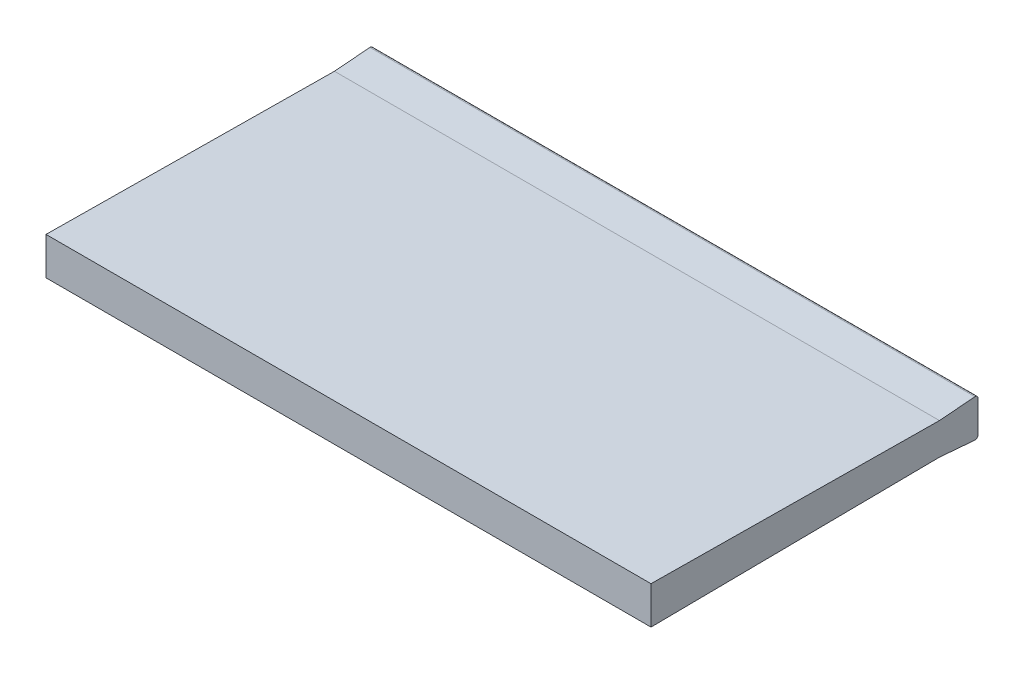
ISO-10303-21;
HEADER;
FILE_DESCRIPTION(('STEP AP214'),'2;1');
FILE_NAME('part.step','',(''),(''),'','','');
FILE_SCHEMA(('AUTOMOTIVE_DESIGN { 1 0 10303 214 1 1 1 1 }'));
ENDSEC;
DATA;
#1=APPLICATION_CONTEXT('core data for automotive mechanical design processes');
#2=APPLICATION_PROTOCOL_DEFINITION('international standard','automotive_design',2000,#1);
#3=PRODUCT_CONTEXT('',#1,'mechanical');
#4=PRODUCT('Part','Part','',(#3));
#5=PRODUCT_RELATED_PRODUCT_CATEGORY('part','',(#4));
#6=PRODUCT_DEFINITION_FORMATION('','',#4);
#7=PRODUCT_DEFINITION_CONTEXT('part definition',#1,'design');
#8=PRODUCT_DEFINITION('design','',#6,#7);
#9=PRODUCT_DEFINITION_SHAPE('','',#8);
#10=(LENGTH_UNIT() NAMED_UNIT(*) SI_UNIT(.MILLI.,.METRE.));
#11=(NAMED_UNIT(*) PLANE_ANGLE_UNIT() SI_UNIT($,.RADIAN.));
#12=(NAMED_UNIT(*) SI_UNIT($,.STERADIAN.) SOLID_ANGLE_UNIT());
#13=UNCERTAINTY_MEASURE_WITH_UNIT(LENGTH_MEASURE(1.E-05),#10,'distance_accuracy_value','');
#14=(GEOMETRIC_REPRESENTATION_CONTEXT(3) GLOBAL_UNCERTAINTY_ASSIGNED_CONTEXT((#13)) GLOBAL_UNIT_ASSIGNED_CONTEXT((#10,
#11,#12)) REPRESENTATION_CONTEXT('',''));
#15=CARTESIAN_POINT('',(0.,0.,0.));
#16=DIRECTION('',(0.,0.,1.));
#17=DIRECTION('',(1.,0.,0.));
#18=AXIS2_PLACEMENT_3D('',#15,#16,#17);
#19=CARTESIAN_POINT('',(-21.,6.15660022588365,-21.));
#20=DIRECTION('',(1.,0.,0.));
#21=DIRECTION('',(0.,1.,0.));
#22=AXIS2_PLACEMENT_3D('',#19,#20,#21);
#23=PLANE('',#22);
#24=CARTESIAN_POINT('',(-21.,6.15660022588365,-21.));
#25=DIRECTION('',(-1.,0.,0.));
#26=DIRECTION('',(0.,0.,-1.));
#27=AXIS2_PLACEMENT_3D('',#24,#25,#26);
#28=CIRCLE('',#27,0.2);
#29=CARTESIAN_POINT('',(-21.,6.35590937753263,-20.9833909040292));
#30=VERTEX_POINT('',#29);
#31=CARTESIAN_POINT('',(-21.,6.15660022588365,-21.2));
#32=VERTEX_POINT('',#31);
#33=EDGE_CURVE('E170',#30,#32,#28,.T.);
#34=ORIENTED_EDGE('',*,*,#33,.T.);
#35=DIRECTION('',(0.,-1.,0.));
#36=VECTOR('',#35,1.);
#37=CARTESIAN_POINT('',(-21.,3.94339977411635,-21.2));
#38=LINE('',#37,#36);
#39=CARTESIAN_POINT('',(-21.,3.94339977411635,-21.2));
#40=VERTEX_POINT('',#39);
#41=EDGE_CURVE('E11',#32,#40,#38,.T.);
#42=ORIENTED_EDGE('',*,*,#41,.T.);
#43=CARTESIAN_POINT('',(-21.,3.94339977411635,-21.));
#44=DIRECTION('',(-1.,0.,0.));
#45=DIRECTION('',(0.,0.,-1.));
#46=AXIS2_PLACEMENT_3D('',#43,#44,#45);
#47=CIRCLE('',#46,0.2);
#48=CARTESIAN_POINT('',(-21.,3.74409062246737,-20.9833909040292));
#49=VERTEX_POINT('',#48);
#50=EDGE_CURVE('E137',#40,#49,#47,.T.);
#51=ORIENTED_EDGE('',*,*,#50,.T.);
#52=DIRECTION('',(0.,0.0830454798537399,0.99654575824488));
#53=VECTOR('',#52,1.);
#54=CARTESIAN_POINT('',(-21.,3.94896372747346,-18.5249136439561));
#55=LINE('',#54,#53);
#56=CARTESIAN_POINT('',(-21.,3.94896372747346,-18.5249136439561));
#57=VERTEX_POINT('',#56);
#58=EDGE_CURVE('E104',#49,#57,#55,.T.);
#59=ORIENTED_EDGE('',*,*,#58,.T.);
#60=DIRECTION('',(0.,-0.0102303753863297,0.999947668340426));
#61=VECTOR('',#60,1.);
#62=CARTESIAN_POINT('',(-21.,3.74409062246737,1.5));
#63=LINE('',#62,#61);
#64=CARTESIAN_POINT('',(-21.,3.74409062246737,1.5));
#65=VERTEX_POINT('',#64);
#66=EDGE_CURVE('E111',#57,#65,#63,.T.);
#67=ORIENTED_EDGE('',*,*,#66,.T.);
#68=DIRECTION('',(0.,1.,0.));
#69=VECTOR('',#68,1.);
#70=CARTESIAN_POINT('',(-21.,6.35590937753263,1.5));
#71=LINE('',#70,#69);
#72=CARTESIAN_POINT('',(-21.,6.35590937753263,1.5));
#73=VERTEX_POINT('',#72);
#74=EDGE_CURVE('E128',#65,#73,#71,.T.);
#75=ORIENTED_EDGE('',*,*,#74,.T.);
#76=DIRECTION('',(0.,-0.0102303753863298,-0.999947668340426));
#77=VECTOR('',#76,1.);
#78=CARTESIAN_POINT('',(-21.,6.15103627252653,-18.5249136439561));
#79=LINE('',#78,#77);
#80=CARTESIAN_POINT('',(-21.,6.15103627252653,-18.5249136439561));
#81=VERTEX_POINT('',#80);
#82=EDGE_CURVE('E157',#73,#81,#79,.T.);
#83=ORIENTED_EDGE('',*,*,#82,.T.);
#84=DIRECTION('',(0.,0.0830454798537402,-0.99654575824488));
#85=VECTOR('',#84,1.);
#86=CARTESIAN_POINT('',(-21.,6.35590937753263,-20.9833909040292));
#87=LINE('',#86,#85);
#88=EDGE_CURVE('E178',#81,#30,#87,.T.);
#89=ORIENTED_EDGE('',*,*,#88,.T.);
#90=EDGE_LOOP('',(#34,#42,#51,#59,#67,#75,#83,#89));
#91=FACE_BOUND('',#90,.T.);
#92=ADVANCED_FACE('F16',(#91),#23,.F.);
#93=CARTESIAN_POINT('',(21.,6.15660022588367,-21.));
#94=DIRECTION('',(1.,0.,0.));
#95=DIRECTION('',(0.,1.,0.));
#96=AXIS2_PLACEMENT_3D('',#93,#94,#95);
#97=PLANE('',#96);
#98=DIRECTION('',(0.,1.,0.));
#99=VECTOR('',#98,1.);
#100=CARTESIAN_POINT('',(21.,3.94339977411637,-21.2));
#101=LINE('',#100,#99);
#102=CARTESIAN_POINT('',(21.,3.94339977411637,-21.2));
#103=VERTEX_POINT('',#102);
#104=CARTESIAN_POINT('',(21.,6.15660022588367,-21.2));
#105=VERTEX_POINT('',#104);
#106=EDGE_CURVE('E20',#103,#105,#101,.T.);
#107=ORIENTED_EDGE('',*,*,#106,.T.);
#108=CARTESIAN_POINT('',(21.,6.15660022588367,-21.));
#109=DIRECTION('',(1.,0.,0.));
#110=DIRECTION('',(0.,0.,-1.));
#111=AXIS2_PLACEMENT_3D('',#108,#109,#110);
#112=CIRCLE('',#111,0.2);
#113=CARTESIAN_POINT('',(21.,6.35590937753265,-20.9833909040292));
#114=VERTEX_POINT('',#113);
#115=EDGE_CURVE('E138',#105,#114,#112,.T.);
#116=ORIENTED_EDGE('',*,*,#115,.T.);
#117=DIRECTION('',(0.,-0.0830454798537402,0.99654575824488));
#118=VECTOR('',#117,1.);
#119=CARTESIAN_POINT('',(21.,6.35590937753265,-20.9833909040292));
#120=LINE('',#119,#118);
#121=CARTESIAN_POINT('',(21.,6.15103627252655,-18.5249136439561));
#122=VERTEX_POINT('',#121);
#123=EDGE_CURVE('E169',#114,#122,#120,.T.);
#124=ORIENTED_EDGE('',*,*,#123,.T.);
#125=DIRECTION('',(0.,0.0102303753863298,0.999947668340426));
#126=VECTOR('',#125,1.);
#127=CARTESIAN_POINT('',(21.,6.15103627252655,-18.5249136439561));
#128=LINE('',#127,#126);
#129=CARTESIAN_POINT('',(21.,6.35590937753265,1.5));
#130=VERTEX_POINT('',#129);
#131=EDGE_CURVE('E160',#122,#130,#128,.T.);
#132=ORIENTED_EDGE('',*,*,#131,.T.);
#133=DIRECTION('',(0.,-1.,0.));
#134=VECTOR('',#133,1.);
#135=CARTESIAN_POINT('',(21.,6.35590937753265,1.5));
#136=LINE('',#135,#134);
#137=CARTESIAN_POINT('',(21.,3.74409062246738,1.5));
#138=VERTEX_POINT('',#137);
#139=EDGE_CURVE('E118',#130,#138,#136,.T.);
#140=ORIENTED_EDGE('',*,*,#139,.T.);
#141=DIRECTION('',(0.,0.0102303753863297,-0.999947668340426));
#142=VECTOR('',#141,1.);
#143=CARTESIAN_POINT('',(21.,3.74409062246738,1.5));
#144=LINE('',#143,#142);
#145=CARTESIAN_POINT('',(21.,3.94896372747348,-18.5249136439561));
#146=VERTEX_POINT('',#145);
#147=EDGE_CURVE('E109',#138,#146,#144,.T.);
#148=ORIENTED_EDGE('',*,*,#147,.T.);
#149=DIRECTION('',(0.,-0.0830454798537399,-0.99654575824488));
#150=VECTOR('',#149,1.);
#151=CARTESIAN_POINT('',(21.,3.94896372747348,-18.5249136439561));
#152=LINE('',#151,#150);
#153=CARTESIAN_POINT('',(21.,3.74409062246738,-20.9833909040292));
#154=VERTEX_POINT('',#153);
#155=EDGE_CURVE('E92',#146,#154,#152,.T.);
#156=ORIENTED_EDGE('',*,*,#155,.T.);
#157=CARTESIAN_POINT('',(21.,3.94339977411637,-21.));
#158=DIRECTION('',(1.,0.,0.));
#159=DIRECTION('',(0.,0.,-1.));
#160=AXIS2_PLACEMENT_3D('',#157,#158,#159);
#161=CIRCLE('',#160,0.2);
#162=EDGE_CURVE('E147',#154,#103,#161,.T.);
#163=ORIENTED_EDGE('',*,*,#162,.T.);
#164=EDGE_LOOP('',(#107,#116,#124,#132,#140,#148,#156,#163));
#165=FACE_BOUND('',#164,.T.);
#166=ADVANCED_FACE('F115',(#165),#97,.T.);
#167=CARTESIAN_POINT('',(43.84991940032,3.94339977411637,-21.2));
#168=DIRECTION('',(0.,0.,1.));
#169=DIRECTION('',(0.,-1.,0.));
#170=AXIS2_PLACEMENT_3D('',#167,#168,#169);
#171=PLANE('',#170);
#172=ORIENTED_EDGE('',*,*,#106,.F.);
#173=DIRECTION('',(-1.,0.,0.));
#174=VECTOR('',#173,1.);
#175=CARTESIAN_POINT('',(43.84991940032,3.94339977411637,-21.2));
#176=LINE('',#175,#174);
#177=EDGE_CURVE('E134',#103,#40,#176,.T.);
#178=ORIENTED_EDGE('',*,*,#177,.T.);
#179=ORIENTED_EDGE('',*,*,#41,.F.);
#180=DIRECTION('',(-1.,0.,0.));
#181=VECTOR('',#180,1.);
#182=CARTESIAN_POINT('',(43.84991940032,6.15660022588368,-21.2));
#183=LINE('',#182,#181);
#184=EDGE_CURVE('E141',#105,#32,#183,.T.);
#185=ORIENTED_EDGE('',*,*,#184,.F.);
#186=EDGE_LOOP('',(#172,#178,#179,#185));
#187=FACE_BOUND('',#186,.T.);
#188=ADVANCED_FACE('F209',(#187),#171,.F.);
#189=CARTESIAN_POINT('',(43.84991940032,3.94339977411637,-21.));
#190=DIRECTION('',(-1.,0.,0.));
#191=DIRECTION('',(0.,0.,1.));
#192=AXIS2_PLACEMENT_3D('',#189,#190,#191);
#193=CYLINDRICAL_SURFACE('',#192,0.2);
#194=ORIENTED_EDGE('',*,*,#162,.F.);
#195=DIRECTION('',(-1.,0.,0.));
#196=VECTOR('',#195,1.);
#197=CARTESIAN_POINT('',(43.84991940032,3.7440906224674,-20.9833909040292));
#198=LINE('',#197,#196);
#199=EDGE_CURVE('E99',#154,#49,#198,.T.);
#200=ORIENTED_EDGE('',*,*,#199,.T.);
#201=ORIENTED_EDGE('',*,*,#50,.F.);
#202=ORIENTED_EDGE('',*,*,#177,.F.);
#203=EDGE_LOOP('',(#194,#200,#201,#202));
#204=FACE_BOUND('',#203,.T.);
#205=ADVANCED_FACE('F214',(#204),#193,.T.);
#206=CARTESIAN_POINT('',(43.84991940032,3.94896372747349,-18.5249136439561));
#207=DIRECTION('',(0.,0.99654575824488,-0.08304547985374));
#208=DIRECTION('',(-1.,0.,0.));
#209=AXIS2_PLACEMENT_3D('',#206,#207,#208);
#210=PLANE('',#209);
#211=ORIENTED_EDGE('',*,*,#155,.F.);
#212=DIRECTION('',(-1.,0.,0.));
#213=VECTOR('',#212,1.);
#214=CARTESIAN_POINT('',(43.84991940032,3.94896372747349,-18.5249136439561));
#215=LINE('',#214,#213);
#216=EDGE_CURVE('E96',#146,#57,#215,.T.);
#217=ORIENTED_EDGE('',*,*,#216,.T.);
#218=ORIENTED_EDGE('',*,*,#58,.F.);
#219=ORIENTED_EDGE('',*,*,#199,.F.);
#220=EDGE_LOOP('',(#211,#217,#218,#219));
#221=FACE_BOUND('',#220,.T.);
#222=ADVANCED_FACE('F94',(#221),#210,.F.);
#223=CARTESIAN_POINT('',(43.84991940032,3.7440906224674,1.5));
#224=DIRECTION('',(0.,0.999947668340426,0.0102303753863297));
#225=DIRECTION('',(1.,0.,0.));
#226=AXIS2_PLACEMENT_3D('',#223,#224,#225);
#227=PLANE('',#226);
#228=ORIENTED_EDGE('',*,*,#147,.F.);
#229=DIRECTION('',(-1.,0.,0.));
#230=VECTOR('',#229,1.);
#231=CARTESIAN_POINT('',(43.84991940032,3.7440906224674,1.5));
#232=LINE('',#231,#230);
#233=EDGE_CURVE('E120',#138,#65,#232,.T.);
#234=ORIENTED_EDGE('',*,*,#233,.T.);
#235=ORIENTED_EDGE('',*,*,#66,.F.);
#236=ORIENTED_EDGE('',*,*,#216,.F.);
#237=EDGE_LOOP('',(#228,#234,#235,#236));
#238=FACE_BOUND('',#237,.T.);
#239=ADVANCED_FACE('F107',(#238),#227,.F.);
#240=CARTESIAN_POINT('',(43.84991940032,6.35590937753266,1.5));
#241=DIRECTION('',(0.,0.,-1.));
#242=DIRECTION('',(0.,-1.,0.));
#243=AXIS2_PLACEMENT_3D('',#240,#241,#242);
#244=PLANE('',#243);
#245=ORIENTED_EDGE('',*,*,#139,.F.);
#246=DIRECTION('',(-1.,0.,0.));
#247=VECTOR('',#246,1.);
#248=CARTESIAN_POINT('',(43.84991940032,6.35590937753266,1.5));
#249=LINE('',#248,#247);
#250=EDGE_CURVE('E159',#130,#73,#249,.T.);
#251=ORIENTED_EDGE('',*,*,#250,.T.);
#252=ORIENTED_EDGE('',*,*,#74,.F.);
#253=ORIENTED_EDGE('',*,*,#233,.F.);
#254=EDGE_LOOP('',(#245,#251,#252,#253));
#255=FACE_BOUND('',#254,.T.);
#256=ADVANCED_FACE('F18',(#255),#244,.F.);
#257=CARTESIAN_POINT('',(43.84991940032,6.15103627252656,-18.5249136439561));
#258=DIRECTION('',(0.,-0.999947668340426,0.0102303753863298));
#259=DIRECTION('',(-1.,0.,0.));
#260=AXIS2_PLACEMENT_3D('',#257,#258,#259);
#261=PLANE('',#260);
#262=ORIENTED_EDGE('',*,*,#131,.F.);
#263=DIRECTION('',(-1.,0.,0.));
#264=VECTOR('',#263,1.);
#265=CARTESIAN_POINT('',(43.84991940032,6.15103627252656,-18.5249136439561));
#266=LINE('',#265,#264);
#267=EDGE_CURVE('E131',#122,#81,#266,.T.);
#268=ORIENTED_EDGE('',*,*,#267,.T.);
#269=ORIENTED_EDGE('',*,*,#82,.F.);
#270=ORIENTED_EDGE('',*,*,#250,.F.);
#271=EDGE_LOOP('',(#262,#268,#269,#270));
#272=FACE_BOUND('',#271,.T.);
#273=ADVANCED_FACE('F193',(#272),#261,.F.);
#274=CARTESIAN_POINT('',(43.84991940032,6.35590937753266,-20.9833909040292));
#275=DIRECTION('',(0.,-0.99654575824488,-0.0830454798537402));
#276=DIRECTION('',(0.,0.0830454798537403,-0.99654575824488));
#277=AXIS2_PLACEMENT_3D('',#274,#275,#276);
#278=PLANE('',#277);
#279=ORIENTED_EDGE('',*,*,#123,.F.);
#280=DIRECTION('',(-1.,0.,0.));
#281=VECTOR('',#280,1.);
#282=CARTESIAN_POINT('',(43.84991940032,6.35590937753266,-20.9833909040292));
#283=LINE('',#282,#281);
#284=EDGE_CURVE('E165',#114,#30,#283,.T.);
#285=ORIENTED_EDGE('',*,*,#284,.T.);
#286=ORIENTED_EDGE('',*,*,#88,.F.);
#287=ORIENTED_EDGE('',*,*,#267,.F.);
#288=EDGE_LOOP('',(#279,#285,#286,#287));
#289=FACE_BOUND('',#288,.T.);
#290=ADVANCED_FACE('F197',(#289),#278,.F.);
#291=CARTESIAN_POINT('',(43.84991940032,6.15660022588368,-21.));
#292=DIRECTION('',(-1.,0.,0.));
#293=DIRECTION('',(0.,0.,1.));
#294=AXIS2_PLACEMENT_3D('',#291,#292,#293);
#295=CYLINDRICAL_SURFACE('',#294,0.2);
#296=ORIENTED_EDGE('',*,*,#115,.F.);
#297=ORIENTED_EDGE('',*,*,#184,.T.);
#298=ORIENTED_EDGE('',*,*,#33,.F.);
#299=ORIENTED_EDGE('',*,*,#284,.F.);
#300=EDGE_LOOP('',(#296,#297,#298,#299));
#301=FACE_BOUND('',#300,.T.);
#302=ADVANCED_FACE('F202',(#301),#295,.T.);
#303=CLOSED_SHELL('',(#92,#166,#188,#205,#222,#239,#256,#273,#290,#302));
#304=MANIFOLD_SOLID_BREP('B1',#303);
#305=ADVANCED_BREP_SHAPE_REPRESENTATION('',(#18,#304),#14);
#306=SHAPE_DEFINITION_REPRESENTATION(#9,#305);
ENDSEC;
END-ISO-10303-21;
